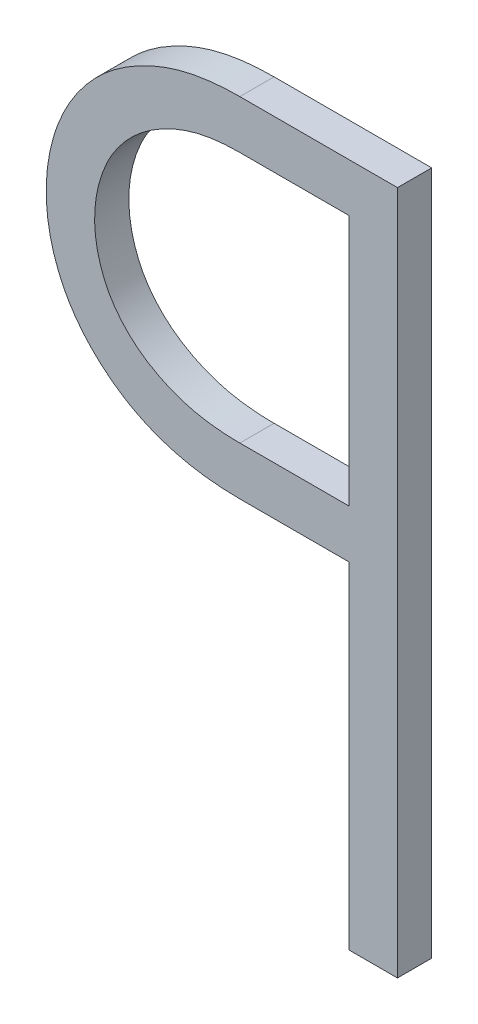
ISO-10303-21;
HEADER;
FILE_DESCRIPTION(('STEP AP214'),'2;1');
FILE_NAME('part.step','',(''),(''),'','','');
FILE_SCHEMA(('AUTOMOTIVE_DESIGN { 1 0 10303 214 1 1 1 1 }'));
ENDSEC;
DATA;
#1=APPLICATION_CONTEXT('core data for automotive mechanical design processes');
#2=APPLICATION_PROTOCOL_DEFINITION('international standard','automotive_design',2000,#1);
#3=PRODUCT_CONTEXT('',#1,'mechanical');
#4=PRODUCT('Part','Part','',(#3));
#5=PRODUCT_RELATED_PRODUCT_CATEGORY('part','',(#4));
#6=PRODUCT_DEFINITION_FORMATION('','',#4);
#7=PRODUCT_DEFINITION_CONTEXT('part definition',#1,'design');
#8=PRODUCT_DEFINITION('design','',#6,#7);
#9=PRODUCT_DEFINITION_SHAPE('','',#8);
#10=(LENGTH_UNIT() NAMED_UNIT(*) SI_UNIT(.MILLI.,.METRE.));
#11=(NAMED_UNIT(*) PLANE_ANGLE_UNIT() SI_UNIT($,.RADIAN.));
#12=(NAMED_UNIT(*) SI_UNIT($,.STERADIAN.) SOLID_ANGLE_UNIT());
#13=UNCERTAINTY_MEASURE_WITH_UNIT(LENGTH_MEASURE(1.E-05),#10,'distance_accuracy_value','');
#14=(GEOMETRIC_REPRESENTATION_CONTEXT(3) GLOBAL_UNCERTAINTY_ASSIGNED_CONTEXT((#13)) GLOBAL_UNIT_ASSIGNED_CONTEXT((#10,
#11,#12)) REPRESENTATION_CONTEXT('',''));
#15=CARTESIAN_POINT('',(0.,0.,0.));
#16=DIRECTION('',(0.,0.,1.));
#17=DIRECTION('',(1.,0.,0.));
#18=AXIS2_PLACEMENT_3D('',#15,#16,#17);
#19=CARTESIAN_POINT('',(69.3114795193496,60.2664998479739,-39.1));
#20=DIRECTION('',(0.,0.,-1.));
#21=DIRECTION('',(-1.,0.,0.));
#22=AXIS2_PLACEMENT_3D('',#19,#20,#21);
#23=PLANE('',#22);
#24=DIRECTION('',(0.,1.,0.));
#25=VECTOR('',#24,1.);
#26=CARTESIAN_POINT('',(70.1962868476903,60.6377070418411,-39.1));
#27=LINE('',#26,#25);
#28=CARTESIAN_POINT('',(70.1962868476903,59.9026168892811,-39.1));
#29=VERTEX_POINT('',#28);
#30=CARTESIAN_POINT('',(70.1962868476903,60.6377070418411,-39.1));
#31=VERTEX_POINT('',#30);
#32=EDGE_CURVE('E146',#29,#31,#27,.T.);
#33=ORIENTED_EDGE('',*,*,#32,.T.);
#34=DIRECTION('',(1.,0.,0.));
#35=VECTOR('',#34,1.);
#36=CARTESIAN_POINT('',(69.8772854606903,60.6377070418411,-39.1));
#37=LINE('',#36,#35);
#38=CARTESIAN_POINT('',(69.8772854606903,60.6377070418411,-39.1));
#39=VERTEX_POINT('',#38);
#40=EDGE_CURVE('E141',#31,#39,#37,.F.);
#41=ORIENTED_EDGE('',*,*,#40,.T.);
#42=CARTESIAN_POINT('',(69.8772854606903,60.6377070418411,-39.1));
#43=CARTESIAN_POINT('',(69.861657774949,60.6376866803021,-39.1));
#44=CARTESIAN_POINT('',(69.8460086153892,60.637145407239,-39.1));
#45=CARTESIAN_POINT('',(69.8147639420482,60.6347689720331,-39.1));
#46=CARTESIAN_POINT('',(69.7991687418792,60.632929830457,-39.1));
#47=CARTESIAN_POINT('',(69.7681894633087,60.6276963614166,-39.1));
#48=CARTESIAN_POINT('',(69.7528059818951,60.6242983095726,-39.1));
#49=CARTESIAN_POINT('',(69.7225628121711,60.6157260384685,-39.1));
#50=CARTESIAN_POINT('',(69.7077023410078,60.6105546102166,-39.1));
#51=CARTESIAN_POINT('',(69.6827057842282,60.6002513097464,-39.1));
#52=CARTESIAN_POINT('',(69.6724058350537,60.5955089417732,-39.1));
#53=CARTESIAN_POINT('',(69.6521913656256,60.5852522212097,-39.1));
#54=CARTESIAN_POINT('',(69.6422770387749,60.5797374874708,-39.1));
#55=CARTESIAN_POINT('',(69.6229103552405,60.5679786850287,-39.1));
#56=CARTESIAN_POINT('',(69.6134572633567,60.5617358346394,-39.1));
#57=CARTESIAN_POINT('',(69.5951477010235,60.548433652632,-39.1));
#58=CARTESIAN_POINT('',(69.5862909352174,60.5413747299874,-39.1));
#59=CARTESIAN_POINT('',(69.5691857588434,60.5264340942821,-39.1));
#60=CARTESIAN_POINT('',(69.5609423157371,60.5185466979403,-39.1));
#61=CARTESIAN_POINT('',(69.5452035678463,60.5020509639065,-39.1));
#62=CARTESIAN_POINT('',(69.5377085985898,60.493442306037,-39.1));
#63=CARTESIAN_POINT('',(69.5235520657562,60.4755670739082,-39.1));
#64=CARTESIAN_POINT('',(69.5168902037516,60.4663007371115,-39.1));
#65=CARTESIAN_POINT('',(69.504533772634,60.4471514286901,-39.1));
#66=CARTESIAN_POINT('',(69.4988386328372,60.4372688256101,-39.1));
#67=CARTESIAN_POINT('',(69.4844780405718,60.4091709522923,-39.1));
#68=CARTESIAN_POINT('',(69.4768989777935,60.3903952227057,-39.1));
#69=CARTESIAN_POINT('',(69.4646645576994,60.3519246838145,-39.1));
#70=CARTESIAN_POINT('',(69.4600111612757,60.3322292675794,-39.1));
#71=CARTESIAN_POINT('',(69.4538194846579,60.2912729281207,-39.1));
#72=CARTESIAN_POINT('',(69.4524553816677,60.2699838026287,-39.1));
#73=CARTESIAN_POINT('',(69.45325756537,60.2381443110813,-39.1));
#74=CARTESIAN_POINT('',(69.4540009683634,60.2275405963091,-39.1));
#75=CARTESIAN_POINT('',(69.4564709429018,60.206443454186,-39.1));
#76=CARTESIAN_POINT('',(69.4581976594552,60.1959500433341,-39.1));
#77=CARTESIAN_POINT('',(69.4624428363355,60.1757299010767,-39.1));
#78=CARTESIAN_POINT('',(69.4649124910722,60.1659927592408,-39.1));
#79=CARTESIAN_POINT('',(69.4706487982595,60.1467574938041,-39.1));
#80=CARTESIAN_POINT('',(69.4739152680844,60.1372593159835,-39.1));
#81=CARTESIAN_POINT('',(69.481269280347,60.118604099767,-39.1));
#82=CARTESIAN_POINT('',(69.485355199177,60.1094464285857,-39.1));
#83=CARTESIAN_POINT('',(69.4944187415277,60.0915777569874,-39.1));
#84=CARTESIAN_POINT('',(69.4993967675099,60.0828669604624,-39.1));
#85=CARTESIAN_POINT('',(69.5148640876597,60.0587047597718,-39.1));
#86=CARTESIAN_POINT('',(69.5264045522038,60.0439172098802,-39.1));
#87=CARTESIAN_POINT('',(69.5517659612374,60.0164447408025,-39.1));
#88=CARTESIAN_POINT('',(69.5655895852169,60.0037623276678,-39.1));
#89=CARTESIAN_POINT('',(69.5893259017859,59.9852710357118,-39.1));
#90=CARTESIAN_POINT('',(69.5986619940146,59.978710161877,-39.1));
#91=CARTESIAN_POINT('',(69.6178714957192,59.9664590285688,-39.1));
#92=CARTESIAN_POINT('',(69.6277445060259,59.9607681339919,-39.1));
#93=CARTESIAN_POINT('',(69.6580388909574,59.9448022605138,-39.1));
#94=CARTESIAN_POINT('',(69.6790852358455,59.9356712813123,-39.1));
#95=CARTESIAN_POINT('',(69.7149139985679,59.9234728528781,-39.1));
#96=CARTESIAN_POINT('',(69.729363512792,59.9193999982105,-39.1));
#97=CARTESIAN_POINT('',(69.7586232788038,59.9127406942196,-39.1));
#98=CARTESIAN_POINT('',(69.7734340988683,59.9101567680719,-39.1));
#99=CARTESIAN_POINT('',(69.8030859722112,59.9061992516943,-39.1));
#100=CARTESIAN_POINT('',(69.8179258525159,59.9048162178469,-39.1));
#101=CARTESIAN_POINT('',(69.8476097100307,59.9030336956338,-39.1));
#102=CARTESIAN_POINT('',(69.8624534540749,59.9026304623111,-39.1));
#103=CARTESIAN_POINT('',(69.8772854606903,59.9026168892811,-39.1));
#104=B_SPLINE_CURVE_WITH_KNOTS('',3,(#42,#43,#44,#45,#46,#47,#48,#49,#50,#51,#52,#53,#54,#55,
#56,#57,#58,#59,#60,#61,#62,#63,#64,#65,#66,#67,#68,#69,#70,#71,#72,#73,#74,#75,#76,#77,#78,#79,
#80,#81,#82,#83,#84,#85,#86,#87,#88,#89,#90,#91,#92,#93,#94,#95,#96,#97,#98,#99,#100,#101,#102,
#103),.UNSPECIFIED.,.F.,.F.,(4,2,2,2,2,2,2,2,2,2,2,2,2,2,2,2,2,2,2,2,2,2,2,2,2,2,2,2,2,2,4),(0.,
0.0469077458016816,0.0939599452838501,0.141125146941786,0.188216456301205,0.222202569963641,
0.256205514639384,0.290152359119915,0.324082264333866,0.358262362045612,0.392457713968139,
0.426640781470161,0.460803599022149,0.521253411935042,0.581743697523237,0.645372894932514,
0.677225234763898,0.709082273053443,0.739185994212519,0.769282822231068,0.799320597048516,
0.829371957251196,0.885333953188434,0.94136209834658,0.975545053999961,1.00970293495968,
1.07820472249515,1.12316564309397,1.16820253320666,1.21288196713351,1.25739035848445),.UNSPECIFIED.);
#105=CARTESIAN_POINT('',(69.8772854606903,59.9026168892811,-39.1));
#106=VERTEX_POINT('',#105);
#107=EDGE_CURVE('E129',#39,#106,#104,.T.);
#108=ORIENTED_EDGE('',*,*,#107,.T.);
#109=DIRECTION('',(1.,0.,0.));
#110=VECTOR('',#109,1.);
#111=CARTESIAN_POINT('',(70.1962868476903,59.9026168892811,-39.1));
#112=LINE('',#111,#110);
#113=EDGE_CURVE('E158',#106,#29,#112,.T.);
#114=ORIENTED_EDGE('',*,*,#113,.T.);
#115=EDGE_LOOP('',(#33,#41,#108,#114));
#116=FACE_BOUND('',#115,.T.);
#117=DIRECTION('',(0.,1.,0.));
#118=VECTOR('',#117,1.);
#119=CARTESIAN_POINT('',(70.1962868476903,59.7611467089711,-39.1));
#120=LINE('',#119,#118);
#121=CARTESIAN_POINT('',(70.1962868476903,58.7791772221511,-39.1));
#122=VERTEX_POINT('',#121);
#123=CARTESIAN_POINT('',(70.1962868476903,59.7611467089711,-39.1));
#124=VERTEX_POINT('',#123);
#125=EDGE_CURVE('E92',#122,#124,#120,.T.);
#126=ORIENTED_EDGE('',*,*,#125,.T.);
#127=DIRECTION('',(1.,0.,0.));
#128=VECTOR('',#127,1.);
#129=CARTESIAN_POINT('',(69.8772854606903,59.7611467089711,-39.1));
#130=LINE('',#129,#128);
#131=CARTESIAN_POINT('',(69.8772854606903,59.7611467089711,-39.1));
#132=VERTEX_POINT('',#131);
#133=EDGE_CURVE('E76',#124,#132,#130,.F.);
#134=ORIENTED_EDGE('',*,*,#133,.T.);
#135=CARTESIAN_POINT('',(69.8772854606903,59.7611467089711,-39.1));
#136=CARTESIAN_POINT('',(69.8437519151114,59.7611166911419,-39.1));
#137=CARTESIAN_POINT('',(69.8100909418719,59.7629795978468,-39.1));
#138=CARTESIAN_POINT('',(69.743131051888,59.7713695903653,-39.1));
#139=CARTESIAN_POINT('',(69.7098364911946,59.7779301850173,-39.1));
#140=CARTESIAN_POINT('',(69.6444273570447,59.7967072865847,-39.1));
#141=CARTESIAN_POINT('',(69.6123268780779,59.8089765652241,-39.1));
#142=CARTESIAN_POINT('',(69.5665588899963,59.8319629171451,-39.1));
#143=CARTESIAN_POINT('',(69.5517107466428,59.8403803669375,-39.1));
#144=CARTESIAN_POINT('',(69.5229216179786,59.8586560868082,-39.1));
#145=CARTESIAN_POINT('',(69.50898078192,59.8685145930788,-39.1));
#146=CARTESIAN_POINT('',(69.4837259484215,59.8883043775588,-39.1));
#147=CARTESIAN_POINT('',(69.4722964015178,59.8980887027619,-39.1));
#148=CARTESIAN_POINT('',(69.4503258927586,59.9185995098753,-39.1));
#149=CARTESIAN_POINT('',(69.4397848277817,59.9293258821513,-39.1));
#150=CARTESIAN_POINT('',(69.4097455389496,59.9629098829417,-39.1));
#151=CARTESIAN_POINT('',(69.391786393642,59.9872068220598,-39.1));
#152=CARTESIAN_POINT('',(69.3626934626573,60.0365326877422,-39.1));
#153=CARTESIAN_POINT('',(69.3510784997998,60.061280749271,-39.1));
#154=CARTESIAN_POINT('',(69.332190407138,60.1123474160352,-39.1));
#155=CARTESIAN_POINT('',(69.3249193866209,60.1386667774351,-39.1));
#156=CARTESIAN_POINT('',(69.3101759188455,60.21728319565,-39.1));
#157=CARTESIAN_POINT('',(69.3088538852289,60.2708911419369,-39.1));
#158=CARTESIAN_POINT('',(69.3191907853442,60.3513849950951,-39.1));
#159=CARTESIAN_POINT('',(69.3251421677176,60.3791886683095,-39.1));
#160=CARTESIAN_POINT('',(69.3373078543044,60.4199278818624,-39.1));
#161=CARTESIAN_POINT('',(69.3419041637055,60.4333493000524,-39.1));
#162=CARTESIAN_POINT('',(69.3521572373332,60.459800643536,-39.1));
#163=CARTESIAN_POINT('',(69.357815263745,60.4728300812218,-39.1));
#164=CARTESIAN_POINT('',(69.3704816055966,60.4988616480722,-39.1));
#165=CARTESIAN_POINT('',(69.3775344935727,60.5118422943429,-39.1));
#166=CARTESIAN_POINT('',(69.392796013698,60.5371073324498,-39.1));
#167=CARTESIAN_POINT('',(69.4010054144763,60.5493912535582,-39.1));
#168=CARTESIAN_POINT('',(69.4271754032458,60.5851008067875,-39.1));
#169=CARTESIAN_POINT('',(69.4466983768354,60.6074257488229,-39.1));
#170=CARTESIAN_POINT('',(69.4781357595281,60.6374526508799,-39.1));
#171=CARTESIAN_POINT('',(69.4886486733642,60.6466681101483,-39.1));
#172=CARTESIAN_POINT('',(69.5104307663415,60.6641388445073,-39.1));
#173=CARTESIAN_POINT('',(69.5216991425848,60.6723951142814,-39.1));
#174=CARTESIAN_POINT('',(69.5448536219994,60.6879985785384,-39.1));
#175=CARTESIAN_POINT('',(69.5567401074601,60.6953452006927,-39.1));
#176=CARTESIAN_POINT('',(69.5809940148653,60.7091999404791,-39.1));
#177=CARTESIAN_POINT('',(69.5933616876387,60.7157076129567,-39.1));
#178=CARTESIAN_POINT('',(69.6328934476769,60.7347115303955,-39.1));
#179=CARTESIAN_POINT('',(69.6608751740413,60.7455924055965,-39.1));
#180=CARTESIAN_POINT('',(69.7038643560444,60.7583359876063,-39.1));
#181=CARTESIAN_POINT('',(69.7183684388694,60.7619881701009,-39.1));
#182=CARTESIAN_POINT('',(69.7476206848312,60.7681496579084,-39.1));
#183=CARTESIAN_POINT('',(69.7623688858879,60.7706587839059,-39.1));
#184=CARTESIAN_POINT('',(69.7937851244897,60.7749231403598,-39.1));
#185=CARTESIAN_POINT('',(69.8104699320997,60.7765507425921,-39.1));
#186=CARTESIAN_POINT('',(69.843868080487,60.77867562853,-39.1));
#187=CARTESIAN_POINT('',(69.8605812261873,60.7791759180983,-39.1));
#188=CARTESIAN_POINT('',(69.8772854606903,60.7791772221511,-39.1));
#189=B_SPLINE_CURVE_WITH_KNOTS('',3,(#135,#136,#137,#138,#139,#140,#141,#142,#143,#144,#145,
#146,#147,#148,#149,#150,#151,#152,#153,#154,#155,#156,#157,#158,#159,#160,#161,#162,#163,#164,
#165,#166,#167,#168,#169,#170,#171,#172,#173,#174,#175,#176,#177,#178,#179,#180,#181,#182,#183,
#184,#185,#186,#187,#188),.UNSPECIFIED.,.F.,.F.,(4,2,2,2,2,2,2,2,2,2,2,2,2,2,2,2,2,2,2,2,2,2,2,
2,2,2,4),(0.,0.100733898325153,0.202193587323596,0.304610405634816,0.35573855070767,
0.406875085209683,0.451954192306453,0.497028060084455,0.587008612760713,0.66857573997646,
0.750182441601222,0.907983133019888,0.992980211163961,1.03549669485327,1.07806404672548,
1.12231582888538,1.166597161163,1.25502249702737,1.29692200800746,1.33877767367751,
1.38065954154434,1.42256354164108,1.51216684414827,1.55699790907434,1.60183600439794,
1.65208865811225,1.70220715895613),.UNSPECIFIED.);
#190=CARTESIAN_POINT('',(69.8772854606903,60.7791772221511,-39.1));
#191=VERTEX_POINT('',#190);
#192=EDGE_CURVE('E24',#132,#191,#189,.T.);
#193=ORIENTED_EDGE('',*,*,#192,.T.);
#194=DIRECTION('',(1.,0.,0.));
#195=VECTOR('',#194,1.);
#196=CARTESIAN_POINT('',(70.3377570279903,60.7791772221511,-39.1));
#197=LINE('',#196,#195);
#198=CARTESIAN_POINT('',(70.3377570279903,60.7791772221511,-39.1));
#199=VERTEX_POINT('',#198);
#200=EDGE_CURVE('E86',#191,#199,#197,.T.);
#201=ORIENTED_EDGE('',*,*,#200,.T.);
#202=DIRECTION('',(0.,1.,0.));
#203=VECTOR('',#202,1.);
#204=CARTESIAN_POINT('',(70.3377570279903,58.7791772221511,-39.1));
#205=LINE('',#204,#203);
#206=CARTESIAN_POINT('',(70.3377570279903,58.7791772221511,-39.1));
#207=VERTEX_POINT('',#206);
#208=EDGE_CURVE('E113',#199,#207,#205,.F.);
#209=ORIENTED_EDGE('',*,*,#208,.T.);
#210=DIRECTION('',(1.,0.,0.));
#211=VECTOR('',#210,1.);
#212=CARTESIAN_POINT('',(70.1962868476903,58.7791772221511,-39.1));
#213=LINE('',#212,#211);
#214=EDGE_CURVE('E179',#207,#122,#213,.F.);
#215=ORIENTED_EDGE('',*,*,#214,.T.);
#216=EDGE_LOOP('',(#126,#134,#193,#201,#209,#215));
#217=FACE_BOUND('',#216,.T.);
#218=ADVANCED_FACE('F17',(#116,#217),#23,.T.);
#219=CARTESIAN_POINT('',(70.3377570279903,60.7791772221511,-39.));
#220=DIRECTION('',(0.,-1.,0.));
#221=DIRECTION('',(0.,0.,-1.));
#222=AXIS2_PLACEMENT_3D('',#219,#220,#221);
#223=PLANE('',#222);
#224=DIRECTION('',(0.,0.,1.));
#225=VECTOR('',#224,1.);
#226=CARTESIAN_POINT('',(69.8772854606903,60.7791772221511,-39.05));
#227=LINE('',#226,#225);
#228=CARTESIAN_POINT('',(69.8772854606903,60.7791772221511,-39.));
#229=VERTEX_POINT('',#228);
#230=EDGE_CURVE('E127',#191,#229,#227,.T.);
#231=ORIENTED_EDGE('',*,*,#230,.T.);
#232=DIRECTION('',(-1.,0.,0.));
#233=VECTOR('',#232,1.);
#234=CARTESIAN_POINT('',(69.3114795193496,60.7791772221511,-39.));
#235=LINE('',#234,#233);
#236=CARTESIAN_POINT('',(70.3377570279903,60.7791772221511,-39.));
#237=VERTEX_POINT('',#236);
#238=EDGE_CURVE('E121',#229,#237,#235,.F.);
#239=ORIENTED_EDGE('',*,*,#238,.T.);
#240=DIRECTION('',(0.,0.,1.));
#241=VECTOR('',#240,1.);
#242=CARTESIAN_POINT('',(70.3377570279903,60.7791772221511,-39.));
#243=LINE('',#242,#241);
#244=EDGE_CURVE('E108',#237,#199,#243,.F.);
#245=ORIENTED_EDGE('',*,*,#244,.T.);
#246=ORIENTED_EDGE('',*,*,#200,.F.);
#247=EDGE_LOOP('',(#231,#239,#245,#246));
#248=FACE_BOUND('',#247,.T.);
#249=ADVANCED_FACE('F126',(#248),#223,.F.);
#250=CARTESIAN_POINT('',(70.3377570279903,58.7791772221511,-39.));
#251=DIRECTION('',(-1.,0.,0.));
#252=DIRECTION('',(0.,0.,1.));
#253=AXIS2_PLACEMENT_3D('',#250,#251,#252);
#254=PLANE('',#253);
#255=ORIENTED_EDGE('',*,*,#244,.F.);
#256=DIRECTION('',(0.,1.,0.));
#257=VECTOR('',#256,1.);
#258=CARTESIAN_POINT('',(70.3377570279903,60.2664998479739,-39.));
#259=LINE('',#258,#257);
#260=CARTESIAN_POINT('',(70.3377570279903,58.7791772221511,-39.));
#261=VERTEX_POINT('',#260);
#262=EDGE_CURVE('E112',#237,#261,#259,.F.);
#263=ORIENTED_EDGE('',*,*,#262,.T.);
#264=DIRECTION('',(0.,0.,1.));
#265=VECTOR('',#264,1.);
#266=CARTESIAN_POINT('',(70.3377570279903,58.7791772221511,-39.));
#267=LINE('',#266,#265);
#268=EDGE_CURVE('E185',#261,#207,#267,.F.);
#269=ORIENTED_EDGE('',*,*,#268,.T.);
#270=ORIENTED_EDGE('',*,*,#208,.F.);
#271=EDGE_LOOP('',(#255,#263,#269,#270));
#272=FACE_BOUND('',#271,.T.);
#273=ADVANCED_FACE('F110',(#272),#254,.F.);
#274=CARTESIAN_POINT('',(70.1962868476903,58.7791772221511,-39.));
#275=DIRECTION('',(0.,1.,0.));
#276=DIRECTION('',(0.,0.,1.));
#277=AXIS2_PLACEMENT_3D('',#274,#275,#276);
#278=PLANE('',#277);
#279=ORIENTED_EDGE('',*,*,#268,.F.);
#280=DIRECTION('',(-1.,0.,0.));
#281=VECTOR('',#280,1.);
#282=CARTESIAN_POINT('',(69.3114795193496,58.7791772221511,-39.));
#283=LINE('',#282,#281);
#284=CARTESIAN_POINT('',(70.1962868476903,58.7791772221511,-39.));
#285=VERTEX_POINT('',#284);
#286=EDGE_CURVE('E124',#261,#285,#283,.T.);
#287=ORIENTED_EDGE('',*,*,#286,.T.);
#288=DIRECTION('',(0.,0.,-1.));
#289=VECTOR('',#288,1.);
#290=CARTESIAN_POINT('',(70.1962868476903,58.7791772221511,-39.));
#291=LINE('',#290,#289);
#292=EDGE_CURVE('E176',#285,#122,#291,.T.);
#293=ORIENTED_EDGE('',*,*,#292,.T.);
#294=ORIENTED_EDGE('',*,*,#214,.F.);
#295=EDGE_LOOP('',(#279,#287,#293,#294));
#296=FACE_BOUND('',#295,.T.);
#297=ADVANCED_FACE('F253',(#296),#278,.F.);
#298=CARTESIAN_POINT('',(70.1962868476903,59.7611467089711,-39.));
#299=DIRECTION('',(1.,0.,0.));
#300=DIRECTION('',(0.,0.,-1.));
#301=AXIS2_PLACEMENT_3D('',#298,#299,#300);
#302=PLANE('',#301);
#303=ORIENTED_EDGE('',*,*,#292,.F.);
#304=DIRECTION('',(0.,1.,0.));
#305=VECTOR('',#304,1.);
#306=CARTESIAN_POINT('',(70.1962868476903,60.2664998479739,-39.));
#307=LINE('',#306,#305);
#308=CARTESIAN_POINT('',(70.1962868476903,59.7611467089711,-39.));
#309=VERTEX_POINT('',#308);
#310=EDGE_CURVE('E170',#285,#309,#307,.T.);
#311=ORIENTED_EDGE('',*,*,#310,.T.);
#312=DIRECTION('',(0.,0.,1.));
#313=VECTOR('',#312,1.);
#314=CARTESIAN_POINT('',(70.1962868476903,59.7611467089711,-39.));
#315=LINE('',#314,#313);
#316=EDGE_CURVE('E165',#309,#124,#315,.F.);
#317=ORIENTED_EDGE('',*,*,#316,.T.);
#318=ORIENTED_EDGE('',*,*,#125,.F.);
#319=EDGE_LOOP('',(#303,#311,#317,#318));
#320=FACE_BOUND('',#319,.T.);
#321=ADVANCED_FACE('F249',(#320),#302,.F.);
#322=CARTESIAN_POINT('',(69.8772854606903,59.7611467089711,-39.));
#323=DIRECTION('',(0.,1.,0.));
#324=DIRECTION('',(0.,0.,1.));
#325=AXIS2_PLACEMENT_3D('',#322,#323,#324);
#326=PLANE('',#325);
#327=ORIENTED_EDGE('',*,*,#316,.F.);
#328=DIRECTION('',(-1.,0.,0.));
#329=VECTOR('',#328,1.);
#330=CARTESIAN_POINT('',(69.3114795193496,59.7611467089711,-39.));
#331=LINE('',#330,#329);
#332=CARTESIAN_POINT('',(69.8772854606903,59.7611467089711,-39.));
#333=VERTEX_POINT('',#332);
#334=EDGE_CURVE('E173',#309,#333,#331,.T.);
#335=ORIENTED_EDGE('',*,*,#334,.T.);
#336=DIRECTION('',(0.,0.,-1.));
#337=VECTOR('',#336,1.);
#338=CARTESIAN_POINT('',(69.8772854606903,59.7611467089711,-39.05));
#339=LINE('',#338,#337);
#340=EDGE_CURVE('E162',#333,#132,#339,.T.);
#341=ORIENTED_EDGE('',*,*,#340,.T.);
#342=ORIENTED_EDGE('',*,*,#133,.F.);
#343=EDGE_LOOP('',(#327,#335,#341,#342));
#344=FACE_BOUND('',#343,.T.);
#345=ADVANCED_FACE('F246',(#344),#326,.F.);
#346=CARTESIAN_POINT('',(69.8772854606903,60.7791772221511,-39.));
#347=CARTESIAN_POINT('',(69.8772854606903,60.7791772221511,-39.1));
#348=CARTESIAN_POINT('',(69.8475971212903,60.7791772221511,-39.));
#349=CARTESIAN_POINT('',(69.8475971212903,60.7791772221511,-39.1));
#350=CARTESIAN_POINT('',(69.7900953570903,60.7761162071711,-39.));
#351=CARTESIAN_POINT('',(69.7900953570903,60.7761162071711,-39.1));
#352=CARTESIAN_POINT('',(69.7074149254903,60.7611683956811,-39.));
#353=CARTESIAN_POINT('',(69.7074149254903,60.7611683956811,-39.1));
#354=CARTESIAN_POINT('',(69.6322804407903,60.7355075733911,-39.));
#355=CARTESIAN_POINT('',(69.6322804407903,60.7355075733911,-39.1));
#356=CARTESIAN_POINT('',(69.5649641988903,60.7017449974511,-39.));
#357=CARTESIAN_POINT('',(69.5649641988903,60.7017449974511,-39.1));
#358=CARTESIAN_POINT('',(69.5050578056903,60.6619214727711,-39.));
#359=CARTESIAN_POINT('',(69.5050578056903,60.6619214727711,-39.1));
#360=CARTESIAN_POINT('',(69.4535402163903,60.6156172297611,-39.));
#361=CARTESIAN_POINT('',(69.4535402163903,60.6156172297611,-39.1));
#362=CARTESIAN_POINT('',(69.4100230924903,60.5641209164811,-39.));
#363=CARTESIAN_POINT('',(69.4100230924903,60.5641209164811,-39.1));
#364=CARTESIAN_POINT('',(69.3740180433903,60.5082000678811,-39.));
#365=CARTESIAN_POINT('',(69.3740180433903,60.5082000678811,-39.1));
#366=CARTESIAN_POINT('',(69.3462514194903,60.4483150175911,-39.));
#367=CARTESIAN_POINT('',(69.3462514194903,60.4483150175911,-39.1));
#368=CARTESIAN_POINT('',(69.3262375980903,60.3859588574211,-39.));
#369=CARTESIAN_POINT('',(69.3262375980903,60.3859588574211,-39.1));
#370=CARTESIAN_POINT('',(69.3140613008903,60.3221387096011,-39.));
#371=CARTESIAN_POINT('',(69.3140613008903,60.3221387096011,-39.1));
#372=CARTESIAN_POINT('',(69.3100871844903,60.2578344576011,-39.));
#373=CARTESIAN_POINT('',(69.3100871844903,60.2578344576011,-39.1));
#374=CARTESIAN_POINT('',(69.3140034504903,60.1939771780511,-39.));
#375=CARTESIAN_POINT('',(69.3140034504903,60.1939771780511,-39.1));
#376=CARTESIAN_POINT('',(69.3261326062903,60.1315022982211,-39.));
#377=CARTESIAN_POINT('',(69.3261326062903,60.1315022982211,-39.1));
#378=CARTESIAN_POINT('',(69.3461711542903,60.0712334381311,-39.));
#379=CARTESIAN_POINT('',(69.3461711542903,60.0712334381311,-39.1));
#380=CARTESIAN_POINT('',(69.3742191868903,60.0139345109911,-39.));
#381=CARTESIAN_POINT('',(69.3742191868903,60.0139345109911,-39.1));
#382=CARTESIAN_POINT('',(69.4107333394903,59.9607344917511,-39.));
#383=CARTESIAN_POINT('',(69.4107333394903,59.9607344917511,-39.1));
#384=CARTESIAN_POINT('',(69.4725106314903,59.8932449539812,-39.));
#385=CARTESIAN_POINT('',(69.4725106314903,59.8932449539812,-39.1));
#386=CARTESIAN_POINT('',(69.5709443999903,59.8217804788611,-39.));
#387=CARTESIAN_POINT('',(69.5709443999903,59.8217804788611,-39.1));
#388=CARTESIAN_POINT('',(69.7170222642903,59.7705889554111,-39.));
#389=CARTESIAN_POINT('',(69.7170222642903,59.7705889554111,-39.1));
#390=CARTESIAN_POINT('',(69.8223375499903,59.7611467089711,-39.));
#391=CARTESIAN_POINT('',(69.8223375499903,59.7611467089711,-39.1));
#392=CARTESIAN_POINT('',(69.8772854606903,59.7611467089711,-39.));
#393=CARTESIAN_POINT('',(69.8772854606903,59.7611467089711,-39.1));
#394=B_SPLINE_SURFACE_WITH_KNOTS('',3,1,((#346,#347),(#348,#349),(#350,#351),(#352,#353),(#354,
#355),(#356,#357),(#358,#359),(#360,#361),(#362,#363),(#364,#365),(#366,#367),(#368,#369),(#370,
#371),(#372,#373),(#374,#375),(#376,#377),(#378,#379),(#380,#381),(#382,#383),(#384,#385),(#386,
#387),(#388,#389),(#390,#391),(#392,#393)),.UNSPECIFIED.,.F.,.F.,.F.,(4,1,1,1,1,1,1,1,1,1,1,1,1,
1,1,1,1,1,1,1,1,4),(2,2),(0.,0.0523334172837,0.1012446402993,0.1476339005722,0.1917742385818,
0.233665297503,0.2740624959879,0.3134480998412,0.3521804118246,0.390949118609,0.4294653200465,
0.4673461414116,0.5051793125637,0.5427413604491,0.5798218237005,0.6170470640946,0.6543849112301,
0.6919085199458,0.7303679457103,0.8153173170425,0.90314002082984,1.),(1.,1.1),.UNSPECIFIED.);
#395=CARTESIAN_POINT('',(69.8772854606903,59.7611467089711,-39.));
#396=CARTESIAN_POINT('',(69.8437519151114,59.7611166911419,-39.));
#397=CARTESIAN_POINT('',(69.8100909418719,59.7629795978467,-39.));
#398=CARTESIAN_POINT('',(69.743131051888,59.7713695903653,-39.));
#399=CARTESIAN_POINT('',(69.7098364911946,59.7779301850173,-39.));
#400=CARTESIAN_POINT('',(69.6444273570447,59.7967072865847,-39.));
#401=CARTESIAN_POINT('',(69.6123268780779,59.8089765652241,-39.));
#402=CARTESIAN_POINT('',(69.5665588899963,59.8319629171451,-39.));
#403=CARTESIAN_POINT('',(69.5517107466428,59.8403803669375,-39.));
#404=CARTESIAN_POINT('',(69.5229216179786,59.8586560868082,-39.));
#405=CARTESIAN_POINT('',(69.50898078192,59.8685145930788,-39.));
#406=CARTESIAN_POINT('',(69.4837259484215,59.8883043775588,-39.));
#407=CARTESIAN_POINT('',(69.4722964015178,59.8980887027619,-39.));
#408=CARTESIAN_POINT('',(69.4503258927586,59.9185995098753,-39.));
#409=CARTESIAN_POINT('',(69.4397848277817,59.9293258821513,-39.));
#410=CARTESIAN_POINT('',(69.4097455389496,59.9629098829417,-39.));
#411=CARTESIAN_POINT('',(69.391786393642,59.9872068220598,-39.));
#412=CARTESIAN_POINT('',(69.3626934626573,60.0365326877422,-39.));
#413=CARTESIAN_POINT('',(69.3510784997998,60.061280749271,-39.));
#414=CARTESIAN_POINT('',(69.332190407138,60.1123474160352,-39.));
#415=CARTESIAN_POINT('',(69.3249193866209,60.1386667774351,-39.));
#416=CARTESIAN_POINT('',(69.3101759188455,60.21728319565,-39.));
#417=CARTESIAN_POINT('',(69.3088538852289,60.2708911419369,-39.));
#418=CARTESIAN_POINT('',(69.3191907853442,60.3513849950951,-39.));
#419=CARTESIAN_POINT('',(69.3251421677177,60.3791886683095,-39.));
#420=CARTESIAN_POINT('',(69.3373078543044,60.4199278818624,-39.));
#421=CARTESIAN_POINT('',(69.3419041637055,60.4333493000524,-39.));
#422=CARTESIAN_POINT('',(69.3521572373332,60.459800643536,-39.));
#423=CARTESIAN_POINT('',(69.357815263745,60.4728300812218,-39.));
#424=CARTESIAN_POINT('',(69.3704816055966,60.4988616480722,-39.));
#425=CARTESIAN_POINT('',(69.3775344935727,60.5118422943429,-39.));
#426=CARTESIAN_POINT('',(69.392796013698,60.5371073324498,-39.));
#427=CARTESIAN_POINT('',(69.4010054144763,60.5493912535582,-39.));
#428=CARTESIAN_POINT('',(69.4271754032458,60.5851008067875,-39.));
#429=CARTESIAN_POINT('',(69.4466983768354,60.6074257488229,-39.));
#430=CARTESIAN_POINT('',(69.4781357595281,60.6374526508799,-39.));
#431=CARTESIAN_POINT('',(69.4886486733642,60.6466681101483,-39.));
#432=CARTESIAN_POINT('',(69.5104307663415,60.6641388445073,-39.));
#433=CARTESIAN_POINT('',(69.5216991425848,60.6723951142814,-39.));
#434=CARTESIAN_POINT('',(69.5448536219994,60.6879985785384,-39.));
#435=CARTESIAN_POINT('',(69.5567401074601,60.6953452006927,-39.));
#436=CARTESIAN_POINT('',(69.5809940148653,60.7091999404791,-39.));
#437=CARTESIAN_POINT('',(69.5933616876387,60.7157076129567,-39.));
#438=CARTESIAN_POINT('',(69.6328934476769,60.7347115303955,-39.));
#439=CARTESIAN_POINT('',(69.6608751740413,60.7455924055965,-39.));
#440=CARTESIAN_POINT('',(69.7038643560444,60.7583359876063,-39.));
#441=CARTESIAN_POINT('',(69.7183684388694,60.7619881701009,-39.));
#442=CARTESIAN_POINT('',(69.7476206848312,60.7681496579084,-39.));
#443=CARTESIAN_POINT('',(69.7623688858879,60.7706587839059,-39.));
#444=CARTESIAN_POINT('',(69.7937851244897,60.7749231403598,-39.));
#445=CARTESIAN_POINT('',(69.8104699320997,60.7765507425922,-39.));
#446=CARTESIAN_POINT('',(69.843868080487,60.77867562853,-39.));
#447=CARTESIAN_POINT('',(69.8605812261873,60.7791759180983,-39.));
#448=CARTESIAN_POINT('',(69.8772854606903,60.7791772221511,-39.));
#449=B_SPLINE_CURVE_WITH_KNOTS('',3,(#395,#396,#397,#398,#399,#400,#401,#402,#403,#404,#405,
#406,#407,#408,#409,#410,#411,#412,#413,#414,#415,#416,#417,#418,#419,#420,#421,#422,#423,#424,
#425,#426,#427,#428,#429,#430,#431,#432,#433,#434,#435,#436,#437,#438,#439,#440,#441,#442,#443,
#444,#445,#446,#447,#448),.UNSPECIFIED.,.F.,.F.,(4,2,2,2,2,2,2,2,2,2,2,2,2,2,2,2,2,2,2,2,2,2,2,
2,2,2,4),(0.,0.100733898325152,0.202193587323598,0.304610405634807,0.355738550707663,
0.406875085209687,0.451954192306463,0.497028060084454,0.587008612760718,0.668575739976471,
0.750182441601227,0.907983133019892,0.992980211163968,1.03549669485328,1.07806404672548,
1.12231582888538,1.16659716116301,1.25502249702737,1.29692200800747,1.33877767367751,
1.38065954154435,1.42256354164108,1.51216684414827,1.55699790907434,1.60183600439794,
1.65208865811225,1.70220715895613),.UNSPECIFIED.);
#450=EDGE_CURVE('E223',#333,#229,#449,.T.);
#451=ORIENTED_EDGE('',*,*,#340,.F.);
#452=ORIENTED_EDGE('',*,*,#450,.T.);
#453=ORIENTED_EDGE('',*,*,#230,.F.);
#454=ORIENTED_EDGE('',*,*,#192,.F.);
#455=EDGE_LOOP('',(#451,#452,#453,#454));
#456=FACE_BOUND('',#455,.T.);
#457=ADVANCED_FACE('F244',(#456),#394,.F.);
#458=CARTESIAN_POINT('',(70.1962868476903,59.9026168892811,-39.));
#459=DIRECTION('',(0.,-1.,0.));
#460=DIRECTION('',(0.,0.,-1.));
#461=AXIS2_PLACEMENT_3D('',#458,#459,#460);
#462=PLANE('',#461);
#463=DIRECTION('',(0.,0.,1.));
#464=VECTOR('',#463,1.);
#465=CARTESIAN_POINT('',(69.8772854606903,59.9026168892811,-39.05));
#466=LINE('',#465,#464);
#467=CARTESIAN_POINT('',(69.8772854606903,59.9026168892811,-39.));
#468=VERTEX_POINT('',#467);
#469=EDGE_CURVE('E138',#106,#468,#466,.T.);
#470=ORIENTED_EDGE('',*,*,#469,.T.);
#471=DIRECTION('',(-1.,0.,0.));
#472=VECTOR('',#471,1.);
#473=CARTESIAN_POINT('',(69.3114795193496,59.9026168892811,-39.));
#474=LINE('',#473,#472);
#475=CARTESIAN_POINT('',(70.1962868476903,59.9026168892811,-39.));
#476=VERTEX_POINT('',#475);
#477=EDGE_CURVE('E152',#468,#476,#474,.F.);
#478=ORIENTED_EDGE('',*,*,#477,.T.);
#479=DIRECTION('',(0.,0.,-1.));
#480=VECTOR('',#479,1.);
#481=CARTESIAN_POINT('',(70.1962868476903,59.9026168892811,-39.));
#482=LINE('',#481,#480);
#483=EDGE_CURVE('E155',#476,#29,#482,.T.);
#484=ORIENTED_EDGE('',*,*,#483,.T.);
#485=ORIENTED_EDGE('',*,*,#113,.F.);
#486=EDGE_LOOP('',(#470,#478,#484,#485));
#487=FACE_BOUND('',#486,.T.);
#488=ADVANCED_FACE('F240',(#487),#462,.F.);
#489=CARTESIAN_POINT('',(70.1962868476903,60.6377070418411,-39.));
#490=DIRECTION('',(1.,0.,0.));
#491=DIRECTION('',(0.,0.,-1.));
#492=AXIS2_PLACEMENT_3D('',#489,#490,#491);
#493=PLANE('',#492);
#494=ORIENTED_EDGE('',*,*,#483,.F.);
#495=DIRECTION('',(0.,1.,0.));
#496=VECTOR('',#495,1.);
#497=CARTESIAN_POINT('',(70.1962868476903,60.2664998479739,-39.));
#498=LINE('',#497,#496);
#499=CARTESIAN_POINT('',(70.1962868476903,60.6377070418411,-39.));
#500=VERTEX_POINT('',#499);
#501=EDGE_CURVE('E149',#476,#500,#498,.T.);
#502=ORIENTED_EDGE('',*,*,#501,.T.);
#503=DIRECTION('',(0.,0.,1.));
#504=VECTOR('',#503,1.);
#505=CARTESIAN_POINT('',(70.1962868476903,60.6377070418411,-39.));
#506=LINE('',#505,#504);
#507=EDGE_CURVE('E143',#500,#31,#506,.F.);
#508=ORIENTED_EDGE('',*,*,#507,.T.);
#509=ORIENTED_EDGE('',*,*,#32,.F.);
#510=EDGE_LOOP('',(#494,#502,#508,#509));
#511=FACE_BOUND('',#510,.T.);
#512=ADVANCED_FACE('F236',(#511),#493,.F.);
#513=CARTESIAN_POINT('',(69.8772854606903,60.6377070418411,-39.));
#514=DIRECTION('',(0.,1.,0.));
#515=DIRECTION('',(0.,0.,1.));
#516=AXIS2_PLACEMENT_3D('',#513,#514,#515);
#517=PLANE('',#516);
#518=ORIENTED_EDGE('',*,*,#507,.F.);
#519=DIRECTION('',(-1.,0.,0.));
#520=VECTOR('',#519,1.);
#521=CARTESIAN_POINT('',(69.3114795193496,60.6377070418411,-39.));
#522=LINE('',#521,#520);
#523=CARTESIAN_POINT('',(69.8772854606903,60.6377070418411,-39.));
#524=VERTEX_POINT('',#523);
#525=EDGE_CURVE('E35',#500,#524,#522,.T.);
#526=ORIENTED_EDGE('',*,*,#525,.T.);
#527=DIRECTION('',(0.,0.,-1.));
#528=VECTOR('',#527,1.);
#529=CARTESIAN_POINT('',(69.8772854606903,60.6377070418411,-39.05));
#530=LINE('',#529,#528);
#531=EDGE_CURVE('E43',#524,#39,#530,.T.);
#532=ORIENTED_EDGE('',*,*,#531,.T.);
#533=ORIENTED_EDGE('',*,*,#40,.F.);
#534=EDGE_LOOP('',(#518,#526,#532,#533));
#535=FACE_BOUND('',#534,.T.);
#536=ADVANCED_FACE('F232',(#535),#517,.F.);
#537=CARTESIAN_POINT('',(69.8772854606903,59.9026168892811,-39.));
#538=CARTESIAN_POINT('',(69.8772854606903,59.9026168892811,-39.1));
#539=CARTESIAN_POINT('',(69.8537826490903,59.9026168892811,-39.));
#540=CARTESIAN_POINT('',(69.8537826490903,59.9026168892811,-39.1));
#541=CARTESIAN_POINT('',(69.8088590622903,59.9045838369211,-39.));
#542=CARTESIAN_POINT('',(69.8088590622903,59.9045838369211,-39.1));
#543=CARTESIAN_POINT('',(69.7449701571903,59.9143790312311,-39.));
#544=CARTESIAN_POINT('',(69.7449701571903,59.9143790312311,-39.1));
#545=CARTESIAN_POINT('',(69.6881028886903,59.9314585757411,-39.));
#546=CARTESIAN_POINT('',(69.6881028886903,59.9314585757411,-39.1));
#547=CARTESIAN_POINT('',(69.6379501505903,59.9542200864511,-39.));
#548=CARTESIAN_POINT('',(69.6379501505903,59.9542200864511,-39.1));
#549=CARTESIAN_POINT('',(69.5935165764903,59.9810264226211,-39.));
#550=CARTESIAN_POINT('',(69.5935165764903,59.9810264226211,-39.1));
#551=CARTESIAN_POINT('',(69.5551753139903,60.0123267770511,-39.));
#552=CARTESIAN_POINT('',(69.5551753139903,60.0123267770511,-39.1));
#553=CARTESIAN_POINT('',(69.5228844845903,60.0473302120611,-39.));
#554=CARTESIAN_POINT('',(69.5228844845903,60.0473302120611,-39.1));
#555=CARTESIAN_POINT('',(69.4965946656903,60.0855932128111,-39.));
#556=CARTESIAN_POINT('',(69.4965946656903,60.0855932128111,-39.1));
#557=CARTESIAN_POINT('',(69.4769541671903,60.1267977846811,-39.));
#558=CARTESIAN_POINT('',(69.4769541671903,60.1267977846811,-39.1));
#559=CARTESIAN_POINT('',(69.4631670380903,60.1696699206311,-39.));
#560=CARTESIAN_POINT('',(69.4631670380903,60.1696699206311,-39.1));
#561=CARTESIAN_POINT('',(69.4547077425903,60.2134556752511,-39.));
#562=CARTESIAN_POINT('',(69.4547077425903,60.2134556752511,-39.1));
#563=CARTESIAN_POINT('',(69.4519284962903,60.2583498299411,-39.));
#564=CARTESIAN_POINT('',(69.4519284962903,60.2583498299411,-39.1));
#565=CARTESIAN_POINT('',(69.4548402949903,60.3040283693211,-39.));
#566=CARTESIAN_POINT('',(69.4548402949903,60.3040283693211,-39.1));
#567=CARTESIAN_POINT('',(69.4637729746903,60.3501351042811,-39.));
#568=CARTESIAN_POINT('',(69.4637729746903,60.3501351042811,-39.1));
#569=CARTESIAN_POINT('',(69.4783516447903,60.3955512290211,-39.));
#570=CARTESIAN_POINT('',(69.4783516447903,60.3955512290211,-39.1));
#571=CARTESIAN_POINT('',(69.4988887221903,60.4394354554611,-39.));
#572=CARTESIAN_POINT('',(69.4988887221903,60.4394354554611,-39.1));
#573=CARTESIAN_POINT('',(69.5260664535903,60.4804651225211,-39.));
#574=CARTESIAN_POINT('',(69.5260664535903,60.4804651225211,-39.1));
#575=CARTESIAN_POINT('',(69.5592045861903,60.5181846341211,-39.));
#576=CARTESIAN_POINT('',(69.5592045861903,60.5181846341211,-39.1));
#577=CARTESIAN_POINT('',(69.5982144092903,60.5520917610211,-39.));
#578=CARTESIAN_POINT('',(69.5982144092903,60.5520917610211,-39.1));
#579=CARTESIAN_POINT('',(69.6430939184903,60.5812693807611,-39.));
#580=CARTESIAN_POINT('',(69.6430939184903,60.5812693807611,-39.1));
#581=CARTESIAN_POINT('',(69.6932405667903,60.6060027962411,-39.));
#582=CARTESIAN_POINT('',(69.6932405667903,60.6060027962411,-39.1));
#583=CARTESIAN_POINT('',(69.7493353498903,60.6246948251911,-39.));
#584=CARTESIAN_POINT('',(69.7493353498903,60.6246948251911,-39.1));
#585=CARTESIAN_POINT('',(69.8114475667903,60.6355076079411,-39.));
#586=CARTESIAN_POINT('',(69.8114475667903,60.6355076079411,-39.1));
#587=CARTESIAN_POINT('',(69.8548033862903,60.6377070418411,-39.));
#588=CARTESIAN_POINT('',(69.8548033862903,60.6377070418411,-39.1));
#589=CARTESIAN_POINT('',(69.8772854606903,60.6377070418411,-39.));
#590=CARTESIAN_POINT('',(69.8772854606903,60.6377070418411,-39.1));
#591=B_SPLINE_SURFACE_WITH_KNOTS('',3,1,((#537,#538),(#539,#540),(#541,#542),(#543,#544),(#545,
#546),(#547,#548),(#549,#550),(#551,#552),(#553,#554),(#555,#556),(#557,#558),(#559,#560),(#561,
#562),(#563,#564),(#565,#566),(#567,#568),(#569,#570),(#571,#572),(#573,#574),(#575,#576),(#577,
#578),(#579,#580),(#581,#582),(#583,#584),(#585,#586),(#587,#588),(#589,#590)),.UNSPECIFIED.,
.F.,.F.,.F.,(4,1,1,1,1,1,1,1,1,1,1,1,1,1,1,1,1,1,1,1,1,1,1,1,4),(2,2),(0.,0.0560829384825,
0.10710786312,0.1538363886604,0.1972858620509,0.2382167619441,0.2773290775821,0.314978632613,
0.3514936594363,0.3876780022759,0.4234959056083,0.4586909002457,0.4938175218323,0.5305422146732,
0.5676122296781,0.6056014689013,0.6440940288952,0.6828511135958,0.7226336141083,0.7635579058485,
0.8057832534696,0.8500229814149,0.8966542992598,0.94635276764713,1.),(1.,1.1),.UNSPECIFIED.);
#592=CARTESIAN_POINT('',(69.8772854606903,60.6377070418411,-39.));
#593=CARTESIAN_POINT('',(69.861657774949,60.6376866803021,-39.));
#594=CARTESIAN_POINT('',(69.8460086153892,60.637145407239,-39.));
#595=CARTESIAN_POINT('',(69.8147639420482,60.6347689720331,-39.));
#596=CARTESIAN_POINT('',(69.7991687418792,60.632929830457,-39.));
#597=CARTESIAN_POINT('',(69.7681894633087,60.6276963614166,-39.));
#598=CARTESIAN_POINT('',(69.7528059818951,60.6242983095726,-39.));
#599=CARTESIAN_POINT('',(69.7225628121711,60.6157260384684,-39.));
#600=CARTESIAN_POINT('',(69.7077023410078,60.6105546102166,-39.));
#601=CARTESIAN_POINT('',(69.6827057842282,60.6002513097464,-39.));
#602=CARTESIAN_POINT('',(69.6724058350537,60.5955089417733,-39.));
#603=CARTESIAN_POINT('',(69.6521913656256,60.5852522212097,-39.));
#604=CARTESIAN_POINT('',(69.6422770387749,60.5797374874708,-39.));
#605=CARTESIAN_POINT('',(69.6229103552405,60.5679786850287,-39.));
#606=CARTESIAN_POINT('',(69.6134572633567,60.5617358346394,-39.));
#607=CARTESIAN_POINT('',(69.5951477010235,60.548433652632,-39.));
#608=CARTESIAN_POINT('',(69.5862909352174,60.5413747299873,-39.));
#609=CARTESIAN_POINT('',(69.5691857588434,60.5264340942821,-39.));
#610=CARTESIAN_POINT('',(69.5609423157371,60.5185466979403,-39.));
#611=CARTESIAN_POINT('',(69.5452035678463,60.5020509639065,-39.));
#612=CARTESIAN_POINT('',(69.5377085985898,60.4934423060369,-39.));
#613=CARTESIAN_POINT('',(69.5235520657562,60.4755670739082,-39.));
#614=CARTESIAN_POINT('',(69.5168902037517,60.4663007371115,-39.));
#615=CARTESIAN_POINT('',(69.504533772634,60.4471514286901,-39.));
#616=CARTESIAN_POINT('',(69.4988386328372,60.4372688256101,-39.));
#617=CARTESIAN_POINT('',(69.4844780405718,60.4091709522923,-39.));
#618=CARTESIAN_POINT('',(69.4768989777935,60.3903952227057,-39.));
#619=CARTESIAN_POINT('',(69.4646645576994,60.3519246838145,-39.));
#620=CARTESIAN_POINT('',(69.4600111612757,60.3322292675794,-39.));
#621=CARTESIAN_POINT('',(69.4538194846579,60.2912729281207,-39.));
#622=CARTESIAN_POINT('',(69.4524553816677,60.2699838026287,-39.));
#623=CARTESIAN_POINT('',(69.45325756537,60.2381443110813,-39.));
#624=CARTESIAN_POINT('',(69.4540009683635,60.2275405963091,-39.));
#625=CARTESIAN_POINT('',(69.4564709429018,60.206443454186,-39.));
#626=CARTESIAN_POINT('',(69.4581976594552,60.1959500433341,-39.));
#627=CARTESIAN_POINT('',(69.4624428363355,60.1757299010767,-39.));
#628=CARTESIAN_POINT('',(69.4649124910723,60.1659927592408,-39.));
#629=CARTESIAN_POINT('',(69.4706487982596,60.1467574938041,-39.));
#630=CARTESIAN_POINT('',(69.4739152680844,60.1372593159835,-39.));
#631=CARTESIAN_POINT('',(69.481269280347,60.118604099767,-39.));
#632=CARTESIAN_POINT('',(69.485355199177,60.1094464285857,-39.));
#633=CARTESIAN_POINT('',(69.4944187415277,60.0915777569874,-39.));
#634=CARTESIAN_POINT('',(69.4993967675099,60.0828669604624,-39.));
#635=CARTESIAN_POINT('',(69.5148640876597,60.0587047597718,-39.));
#636=CARTESIAN_POINT('',(69.5264045522038,60.0439172098802,-39.));
#637=CARTESIAN_POINT('',(69.5517659612374,60.0164447408025,-39.));
#638=CARTESIAN_POINT('',(69.5655895852169,60.0037623276678,-39.));
#639=CARTESIAN_POINT('',(69.5893259017859,59.9852710357118,-39.));
#640=CARTESIAN_POINT('',(69.5986619940146,59.9787101618771,-39.));
#641=CARTESIAN_POINT('',(69.6178714957192,59.9664590285688,-39.));
#642=CARTESIAN_POINT('',(69.6277445060259,59.9607681339919,-39.));
#643=CARTESIAN_POINT('',(69.6580388909574,59.9448022605138,-39.));
#644=CARTESIAN_POINT('',(69.6790852358455,59.9356712813123,-39.));
#645=CARTESIAN_POINT('',(69.7149139985679,59.9234728528781,-39.));
#646=CARTESIAN_POINT('',(69.729363512792,59.9193999982105,-39.));
#647=CARTESIAN_POINT('',(69.7586232788037,59.9127406942196,-39.));
#648=CARTESIAN_POINT('',(69.7734340988683,59.9101567680719,-39.));
#649=CARTESIAN_POINT('',(69.8030859722112,59.9061992516943,-39.));
#650=CARTESIAN_POINT('',(69.8179258525159,59.9048162178469,-39.));
#651=CARTESIAN_POINT('',(69.8476097100307,59.9030336956338,-39.));
#652=CARTESIAN_POINT('',(69.8624534540749,59.9026304623111,-39.));
#653=CARTESIAN_POINT('',(69.8772854606903,59.9026168892811,-39.));
#654=B_SPLINE_CURVE_WITH_KNOTS('',3,(#592,#593,#594,#595,#596,#597,#598,#599,#600,#601,#602,
#603,#604,#605,#606,#607,#608,#609,#610,#611,#612,#613,#614,#615,#616,#617,#618,#619,#620,#621,
#622,#623,#624,#625,#626,#627,#628,#629,#630,#631,#632,#633,#634,#635,#636,#637,#638,#639,#640,
#641,#642,#643,#644,#645,#646,#647,#648,#649,#650,#651,#652,#653),.UNSPECIFIED.,.F.,.F.,(4,2,2,
2,2,2,2,2,2,2,2,2,2,2,2,2,2,2,2,2,2,2,2,2,2,2,2,2,2,2,4),(0.,0.0469077458016816,
0.0939599452838493,0.141125146941788,0.188216456301205,0.222202569963638,0.256205514639385,
0.290152359119919,0.324082264333866,0.358262362045622,0.392457713968145,0.426640781470167,
0.460803599022149,0.521253411935048,0.581743697523239,0.645372894932516,0.677225234763902,
0.709082273053443,0.739185994212522,0.769282822231067,0.79932059704852,0.829371957251193,
0.885333953188426,0.941362098346577,0.975545053999961,1.00970293495967,1.07820472249514,
1.12316564309395,1.16820253320665,1.21288196713352,1.25739035848445),.UNSPECIFIED.);
#655=EDGE_CURVE('E11',#524,#468,#654,.T.);
#656=ORIENTED_EDGE('',*,*,#531,.F.);
#657=ORIENTED_EDGE('',*,*,#655,.T.);
#658=ORIENTED_EDGE('',*,*,#469,.F.);
#659=ORIENTED_EDGE('',*,*,#107,.F.);
#660=EDGE_LOOP('',(#656,#657,#658,#659));
#661=FACE_BOUND('',#660,.T.);
#662=ADVANCED_FACE('F19',(#661),#591,.F.);
#663=CARTESIAN_POINT('',(69.3114795193496,60.2664998479739,-39.));
#664=DIRECTION('',(0.,0.,-1.));
#665=DIRECTION('',(-1.,0.,0.));
#666=AXIS2_PLACEMENT_3D('',#663,#664,#665);
#667=PLANE('',#666);
#668=ORIENTED_EDGE('',*,*,#525,.F.);
#669=ORIENTED_EDGE('',*,*,#501,.F.);
#670=ORIENTED_EDGE('',*,*,#477,.F.);
#671=ORIENTED_EDGE('',*,*,#655,.F.);
#672=EDGE_LOOP('',(#668,#669,#670,#671));
#673=FACE_BOUND('',#672,.T.);
#674=ORIENTED_EDGE('',*,*,#334,.F.);
#675=ORIENTED_EDGE('',*,*,#310,.F.);
#676=ORIENTED_EDGE('',*,*,#286,.F.);
#677=ORIENTED_EDGE('',*,*,#262,.F.);
#678=ORIENTED_EDGE('',*,*,#238,.F.);
#679=ORIENTED_EDGE('',*,*,#450,.F.);
#680=EDGE_LOOP('',(#674,#675,#676,#677,#678,#679));
#681=FACE_BOUND('',#680,.T.);
#682=ADVANCED_FACE('F119',(#673,#681),#667,.F.);
#683=CLOSED_SHELL('',(#218,#249,#273,#297,#321,#345,#457,#488,#512,#536,#662,#682));
#684=MANIFOLD_SOLID_BREP('B1',#683);
#685=ADVANCED_BREP_SHAPE_REPRESENTATION('',(#18,#684),#14);
#686=SHAPE_DEFINITION_REPRESENTATION(#9,#685);
ENDSEC;
END-ISO-10303-21;
